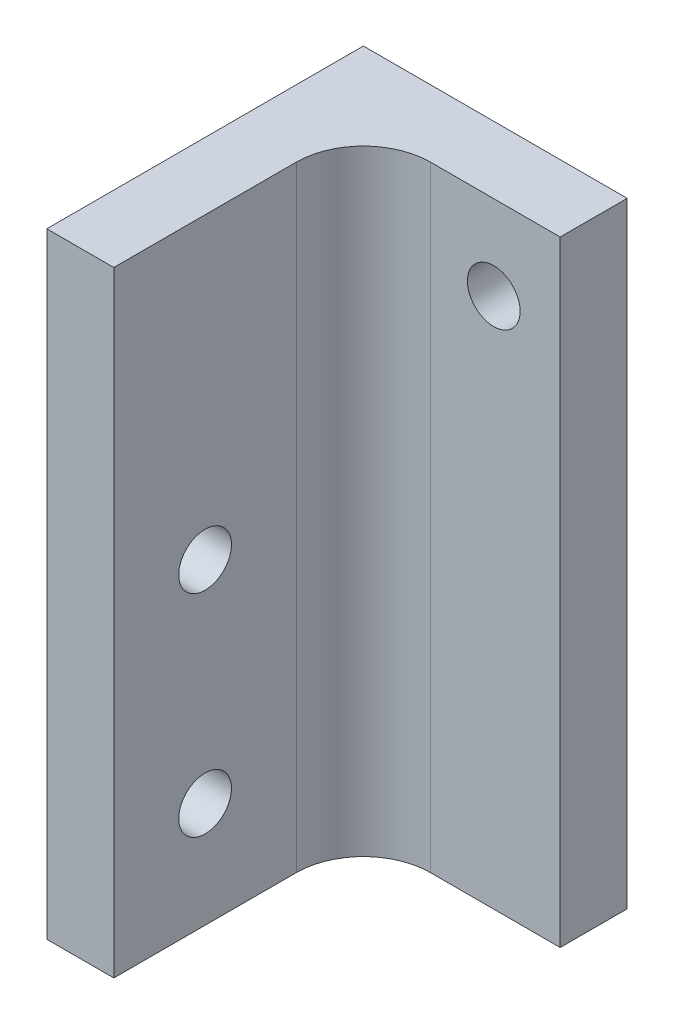
ISO-10303-21;
HEADER;
FILE_DESCRIPTION(('STEP AP214'),'2;1');
FILE_NAME('part.step','',(''),(''),'','','');
FILE_SCHEMA(('AUTOMOTIVE_DESIGN { 1 0 10303 214 1 1 1 1 }'));
ENDSEC;
DATA;
#1=APPLICATION_CONTEXT('core data for automotive mechanical design processes');
#2=APPLICATION_PROTOCOL_DEFINITION('international standard','automotive_design',2000,#1);
#3=PRODUCT_CONTEXT('',#1,'mechanical');
#4=PRODUCT('Part','Part','',(#3));
#5=PRODUCT_RELATED_PRODUCT_CATEGORY('part','',(#4));
#6=PRODUCT_DEFINITION_FORMATION('','',#4);
#7=PRODUCT_DEFINITION_CONTEXT('part definition',#1,'design');
#8=PRODUCT_DEFINITION('design','',#6,#7);
#9=PRODUCT_DEFINITION_SHAPE('','',#8);
#10=(LENGTH_UNIT() NAMED_UNIT(*) SI_UNIT(.MILLI.,.METRE.));
#11=(NAMED_UNIT(*) PLANE_ANGLE_UNIT() SI_UNIT($,.RADIAN.));
#12=(NAMED_UNIT(*) SI_UNIT($,.STERADIAN.) SOLID_ANGLE_UNIT());
#13=UNCERTAINTY_MEASURE_WITH_UNIT(LENGTH_MEASURE(1.E-05),#10,'distance_accuracy_value','');
#14=(GEOMETRIC_REPRESENTATION_CONTEXT(3) GLOBAL_UNCERTAINTY_ASSIGNED_CONTEXT((#13)) GLOBAL_UNIT_ASSIGNED_CONTEXT((#10,
#11,#12)) REPRESENTATION_CONTEXT('',''));
#15=CARTESIAN_POINT('',(0.,0.,0.));
#16=DIRECTION('',(0.,0.,1.));
#17=DIRECTION('',(1.,0.,0.));
#18=AXIS2_PLACEMENT_3D('',#15,#16,#17);
#19=CARTESIAN_POINT('',(0.,58.31,0.));
#20=DIRECTION('',(0.,0.,-1.));
#21=DIRECTION('',(-1.,0.,0.));
#22=AXIS2_PLACEMENT_3D('',#19,#20,#21);
#23=PLANE('',#22);
#24=DIRECTION('',(1.,0.,0.));
#25=VECTOR('',#24,1.);
#26=CARTESIAN_POINT('',(0.,0.,0.));
#27=LINE('',#26,#25);
#28=CARTESIAN_POINT('',(0.,0.,0.));
#29=VERTEX_POINT('',#28);
#30=CARTESIAN_POINT('',(6.35,0.,0.));
#31=VERTEX_POINT('',#30);
#32=EDGE_CURVE('E124',#29,#31,#27,.T.);
#33=ORIENTED_EDGE('',*,*,#32,.T.);
#34=DIRECTION('',(0.,-1.,0.));
#35=VECTOR('',#34,1.);
#36=CARTESIAN_POINT('',(6.35,58.31,0.));
#37=LINE('',#36,#35);
#38=CARTESIAN_POINT('',(6.35,58.31,0.));
#39=VERTEX_POINT('',#38);
#40=EDGE_CURVE('E11',#39,#31,#37,.T.);
#41=ORIENTED_EDGE('',*,*,#40,.F.);
#42=DIRECTION('',(1.,0.,0.));
#43=VECTOR('',#42,1.);
#44=CARTESIAN_POINT('',(0.,58.31,0.));
#45=LINE('',#44,#43);
#46=CARTESIAN_POINT('',(0.,58.31,0.));
#47=VERTEX_POINT('',#46);
#48=EDGE_CURVE('E137',#47,#39,#45,.T.);
#49=ORIENTED_EDGE('',*,*,#48,.F.);
#50=DIRECTION('',(0.,-1.,0.));
#51=VECTOR('',#50,1.);
#52=CARTESIAN_POINT('',(0.,58.31,0.));
#53=LINE('',#52,#51);
#54=EDGE_CURVE('E120',#47,#29,#53,.T.);
#55=ORIENTED_EDGE('',*,*,#54,.T.);
#56=EDGE_LOOP('',(#33,#41,#49,#55));
#57=FACE_BOUND('',#56,.T.);
#58=ADVANCED_FACE('F34',(#57),#23,.F.);
#59=CARTESIAN_POINT('',(6.35,58.31,0.));
#60=DIRECTION('',(-1.,0.,0.));
#61=DIRECTION('',(0.,0.,1.));
#62=AXIS2_PLACEMENT_3D('',#59,#60,#61);
#63=PLANE('',#62);
#64=CARTESIAN_POINT('',(6.35,10.,-8.65));
#65=DIRECTION('',(1.,0.,0.));
#66=DIRECTION('',(0.,0.,-1.));
#67=AXIS2_PLACEMENT_3D('',#64,#65,#66);
#68=CIRCLE('',#67,2.5);
#69=CARTESIAN_POINT('',(6.35,10.,-11.15));
#70=VERTEX_POINT('',#69);
#71=EDGE_CURVE('E167',#70,#70,#68,.T.);
#72=ORIENTED_EDGE('',*,*,#71,.F.);
#73=EDGE_LOOP('',(#72));
#74=FACE_BOUND('',#73,.T.);
#75=CARTESIAN_POINT('',(6.35,30.,-8.65));
#76=DIRECTION('',(1.,0.,0.));
#77=DIRECTION('',(0.,0.,-1.));
#78=AXIS2_PLACEMENT_3D('',#75,#76,#77);
#79=CIRCLE('',#78,2.5);
#80=CARTESIAN_POINT('',(6.35,30.,-11.15));
#81=VERTEX_POINT('',#80);
#82=EDGE_CURVE('E160',#81,#81,#79,.T.);
#83=ORIENTED_EDGE('',*,*,#82,.F.);
#84=EDGE_LOOP('',(#83));
#85=FACE_BOUND('',#84,.T.);
#86=DIRECTION('',(0.,0.,-1.));
#87=VECTOR('',#86,1.);
#88=CARTESIAN_POINT('',(6.35,0.,0.));
#89=LINE('',#88,#87);
#90=CARTESIAN_POINT('',(6.35,0.,-17.3));
#91=VERTEX_POINT('',#90);
#92=EDGE_CURVE('E127',#31,#91,#89,.T.);
#93=ORIENTED_EDGE('',*,*,#92,.T.);
#94=DIRECTION('',(0.,-1.,0.));
#95=VECTOR('',#94,1.);
#96=CARTESIAN_POINT('',(6.35,58.31,-17.3));
#97=LINE('',#96,#95);
#98=CARTESIAN_POINT('',(6.35,58.31,-17.3));
#99=VERTEX_POINT('',#98);
#100=EDGE_CURVE('E42',#99,#91,#97,.T.);
#101=ORIENTED_EDGE('',*,*,#100,.F.);
#102=DIRECTION('',(0.,0.,-1.));
#103=VECTOR('',#102,1.);
#104=CARTESIAN_POINT('',(6.35,58.31,0.));
#105=LINE('',#104,#103);
#106=EDGE_CURVE('E90',#39,#99,#105,.T.);
#107=ORIENTED_EDGE('',*,*,#106,.F.);
#108=ORIENTED_EDGE('',*,*,#40,.T.);
#109=EDGE_LOOP('',(#93,#101,#107,#108));
#110=FACE_BOUND('',#109,.T.);
#111=ADVANCED_FACE('F193',(#74,#85,#110),#63,.F.);
#112=CARTESIAN_POINT('',(12.7,58.31,-17.3));
#113=DIRECTION('',(0.,-1.,0.));
#114=DIRECTION('',(0.,0.,-1.));
#115=AXIS2_PLACEMENT_3D('',#112,#113,#114);
#116=CYLINDRICAL_SURFACE('',#115,6.35);
#117=CARTESIAN_POINT('',(12.7,0.,-17.3));
#118=DIRECTION('',(0.,-1.,0.));
#119=DIRECTION('',(0.,0.,-1.));
#120=AXIS2_PLACEMENT_3D('',#117,#118,#119);
#121=CIRCLE('',#120,6.35);
#122=CARTESIAN_POINT('',(12.7,0.,-23.65));
#123=VERTEX_POINT('',#122);
#124=EDGE_CURVE('E130',#91,#123,#121,.T.);
#125=ORIENTED_EDGE('',*,*,#124,.T.);
#126=DIRECTION('',(0.,-1.,0.));
#127=VECTOR('',#126,1.);
#128=CARTESIAN_POINT('',(12.7,58.31,-23.65));
#129=LINE('',#128,#127);
#130=CARTESIAN_POINT('',(12.7,58.31,-23.65));
#131=VERTEX_POINT('',#130);
#132=EDGE_CURVE('E141',#131,#123,#129,.T.);
#133=ORIENTED_EDGE('',*,*,#132,.F.);
#134=CARTESIAN_POINT('',(12.7,58.31,-17.3));
#135=DIRECTION('',(0.,-1.,0.));
#136=DIRECTION('',(0.,0.,-1.));
#137=AXIS2_PLACEMENT_3D('',#134,#135,#136);
#138=CIRCLE('',#137,6.35);
#139=EDGE_CURVE('E149',#99,#131,#138,.T.);
#140=ORIENTED_EDGE('',*,*,#139,.F.);
#141=ORIENTED_EDGE('',*,*,#100,.T.);
#142=EDGE_LOOP('',(#125,#133,#140,#141));
#143=FACE_BOUND('',#142,.T.);
#144=ADVANCED_FACE('F147',(#143),#116,.F.);
#145=CARTESIAN_POINT('',(12.7,58.31,-23.65));
#146=DIRECTION('',(0.,0.,-1.));
#147=DIRECTION('',(-1.,0.,0.));
#148=AXIS2_PLACEMENT_3D('',#145,#146,#147);
#149=PLANE('',#148);
#150=CARTESIAN_POINT('',(18.7067209617219,50.31,-23.65));
#151=DIRECTION('',(0.,0.,1.));
#152=DIRECTION('',(1.,0.,0.));
#153=AXIS2_PLACEMENT_3D('',#150,#151,#152);
#154=CIRCLE('',#153,2.5);
#155=CARTESIAN_POINT('',(21.2067209617219,50.31,-23.65));
#156=VERTEX_POINT('',#155);
#157=EDGE_CURVE('E172',#156,#156,#154,.T.);
#158=ORIENTED_EDGE('',*,*,#157,.F.);
#159=EDGE_LOOP('',(#158));
#160=FACE_BOUND('',#159,.T.);
#161=DIRECTION('',(1.,0.,0.));
#162=VECTOR('',#161,1.);
#163=CARTESIAN_POINT('',(12.7,0.,-23.65));
#164=LINE('',#163,#162);
#165=CARTESIAN_POINT('',(25.,0.,-23.65));
#166=VERTEX_POINT('',#165);
#167=EDGE_CURVE('E132',#123,#166,#164,.T.);
#168=ORIENTED_EDGE('',*,*,#167,.T.);
#169=DIRECTION('',(0.,-1.,0.));
#170=VECTOR('',#169,1.);
#171=CARTESIAN_POINT('',(25.,58.31,-23.65));
#172=LINE('',#171,#170);
#173=CARTESIAN_POINT('',(25.,58.31,-23.65));
#174=VERTEX_POINT('',#173);
#175=EDGE_CURVE('E115',#174,#166,#172,.T.);
#176=ORIENTED_EDGE('',*,*,#175,.F.);
#177=DIRECTION('',(1.,0.,0.));
#178=VECTOR('',#177,1.);
#179=CARTESIAN_POINT('',(12.7,58.31,-23.65));
#180=LINE('',#179,#178);
#181=EDGE_CURVE('E106',#131,#174,#180,.T.);
#182=ORIENTED_EDGE('',*,*,#181,.F.);
#183=ORIENTED_EDGE('',*,*,#132,.T.);
#184=EDGE_LOOP('',(#168,#176,#182,#183));
#185=FACE_BOUND('',#184,.T.);
#186=ADVANCED_FACE('F155',(#160,#185),#149,.F.);
#187=CARTESIAN_POINT('',(25.,58.31,-30.));
#188=DIRECTION('',(-1.,0.,0.));
#189=DIRECTION('',(0.,0.,1.));
#190=AXIS2_PLACEMENT_3D('',#187,#188,#189);
#191=PLANE('',#190);
#192=DIRECTION('',(0.,0.,-1.));
#193=VECTOR('',#192,1.);
#194=CARTESIAN_POINT('',(25.,0.,-30.));
#195=LINE('',#194,#193);
#196=CARTESIAN_POINT('',(25.,0.,-30.));
#197=VERTEX_POINT('',#196);
#198=EDGE_CURVE('E114',#166,#197,#195,.T.);
#199=ORIENTED_EDGE('',*,*,#198,.T.);
#200=DIRECTION('',(0.,-1.,0.));
#201=VECTOR('',#200,1.);
#202=CARTESIAN_POINT('',(25.,58.31,-30.));
#203=LINE('',#202,#201);
#204=CARTESIAN_POINT('',(25.,58.31,-30.));
#205=VERTEX_POINT('',#204);
#206=EDGE_CURVE('E111',#205,#197,#203,.T.);
#207=ORIENTED_EDGE('',*,*,#206,.F.);
#208=DIRECTION('',(0.,0.,-1.));
#209=VECTOR('',#208,1.);
#210=CARTESIAN_POINT('',(25.,58.31,-30.));
#211=LINE('',#210,#209);
#212=EDGE_CURVE('E100',#174,#205,#211,.T.);
#213=ORIENTED_EDGE('',*,*,#212,.F.);
#214=ORIENTED_EDGE('',*,*,#175,.T.);
#215=EDGE_LOOP('',(#199,#207,#213,#214));
#216=FACE_BOUND('',#215,.T.);
#217=ADVANCED_FACE('F112',(#216),#191,.F.);
#218=CARTESIAN_POINT('',(0.,58.31,-30.));
#219=DIRECTION('',(0.,0.,1.));
#220=DIRECTION('',(1.,0.,0.));
#221=AXIS2_PLACEMENT_3D('',#218,#219,#220);
#222=PLANE('',#221);
#223=CARTESIAN_POINT('',(18.7067209617219,50.31,-30.));
#224=DIRECTION('',(0.,0.,1.));
#225=DIRECTION('',(1.,0.,0.));
#226=AXIS2_PLACEMENT_3D('',#223,#224,#225);
#227=CIRCLE('',#226,2.5);
#228=CARTESIAN_POINT('',(21.2067209617219,50.31,-30.));
#229=VERTEX_POINT('',#228);
#230=EDGE_CURVE('E164',#229,#229,#227,.T.);
#231=ORIENTED_EDGE('',*,*,#230,.T.);
#232=EDGE_LOOP('',(#231));
#233=FACE_BOUND('',#232,.T.);
#234=DIRECTION('',(-1.,0.,0.));
#235=VECTOR('',#234,1.);
#236=CARTESIAN_POINT('',(0.,0.,-30.));
#237=LINE('',#236,#235);
#238=CARTESIAN_POINT('',(0.,0.,-30.));
#239=VERTEX_POINT('',#238);
#240=EDGE_CURVE('E76',#197,#239,#237,.T.);
#241=ORIENTED_EDGE('',*,*,#240,.T.);
#242=DIRECTION('',(0.,-1.,0.));
#243=VECTOR('',#242,1.);
#244=CARTESIAN_POINT('',(0.,58.31,-30.));
#245=LINE('',#244,#243);
#246=CARTESIAN_POINT('',(0.,58.31,-30.));
#247=VERTEX_POINT('',#246);
#248=EDGE_CURVE('E116',#247,#239,#245,.T.);
#249=ORIENTED_EDGE('',*,*,#248,.F.);
#250=DIRECTION('',(-1.,0.,0.));
#251=VECTOR('',#250,1.);
#252=CARTESIAN_POINT('',(0.,58.31,-30.));
#253=LINE('',#252,#251);
#254=EDGE_CURVE('E104',#205,#247,#253,.T.);
#255=ORIENTED_EDGE('',*,*,#254,.F.);
#256=ORIENTED_EDGE('',*,*,#206,.T.);
#257=EDGE_LOOP('',(#241,#249,#255,#256));
#258=FACE_BOUND('',#257,.T.);
#259=ADVANCED_FACE('F118',(#233,#258),#222,.F.);
#260=CARTESIAN_POINT('',(0.,58.31,0.));
#261=DIRECTION('',(1.,0.,0.));
#262=DIRECTION('',(0.,0.,-1.));
#263=AXIS2_PLACEMENT_3D('',#260,#261,#262);
#264=PLANE('',#263);
#265=CARTESIAN_POINT('',(0.,10.,-8.65));
#266=DIRECTION('',(1.,0.,0.));
#267=DIRECTION('',(0.,0.,-1.));
#268=AXIS2_PLACEMENT_3D('',#265,#266,#267);
#269=CIRCLE('',#268,2.5);
#270=CARTESIAN_POINT('',(0.,10.,-11.15));
#271=VERTEX_POINT('',#270);
#272=EDGE_CURVE('E128',#271,#271,#269,.T.);
#273=ORIENTED_EDGE('',*,*,#272,.T.);
#274=EDGE_LOOP('',(#273));
#275=FACE_BOUND('',#274,.T.);
#276=CARTESIAN_POINT('',(0.,30.,-8.65));
#277=DIRECTION('',(1.,0.,0.));
#278=DIRECTION('',(0.,0.,-1.));
#279=AXIS2_PLACEMENT_3D('',#276,#277,#278);
#280=CIRCLE('',#279,2.5);
#281=CARTESIAN_POINT('',(0.,30.,-11.15));
#282=VERTEX_POINT('',#281);
#283=EDGE_CURVE('E163',#282,#282,#280,.T.);
#284=ORIENTED_EDGE('',*,*,#283,.T.);
#285=EDGE_LOOP('',(#284));
#286=FACE_BOUND('',#285,.T.);
#287=DIRECTION('',(0.,0.,1.));
#288=VECTOR('',#287,1.);
#289=CARTESIAN_POINT('',(0.,0.,0.));
#290=LINE('',#289,#288);
#291=EDGE_CURVE('E82',#239,#29,#290,.T.);
#292=ORIENTED_EDGE('',*,*,#291,.T.);
#293=ORIENTED_EDGE('',*,*,#54,.F.);
#294=DIRECTION('',(0.,0.,1.));
#295=VECTOR('',#294,1.);
#296=CARTESIAN_POINT('',(0.,58.31,0.));
#297=LINE('',#296,#295);
#298=EDGE_CURVE('E50',#247,#47,#297,.T.);
#299=ORIENTED_EDGE('',*,*,#298,.F.);
#300=ORIENTED_EDGE('',*,*,#248,.T.);
#301=EDGE_LOOP('',(#292,#293,#299,#300));
#302=FACE_BOUND('',#301,.T.);
#303=ADVANCED_FACE('F203',(#275,#286,#302),#264,.F.);
#304=CARTESIAN_POINT('',(12.7,58.31,-17.3));
#305=DIRECTION('',(0.,-1.,0.));
#306=DIRECTION('',(0.,0.,-1.));
#307=AXIS2_PLACEMENT_3D('',#304,#305,#306);
#308=PLANE('',#307);
#309=ORIENTED_EDGE('',*,*,#48,.T.);
#310=ORIENTED_EDGE('',*,*,#106,.T.);
#311=ORIENTED_EDGE('',*,*,#139,.T.);
#312=ORIENTED_EDGE('',*,*,#181,.T.);
#313=ORIENTED_EDGE('',*,*,#212,.T.);
#314=ORIENTED_EDGE('',*,*,#254,.T.);
#315=ORIENTED_EDGE('',*,*,#298,.T.);
#316=EDGE_LOOP('',(#309,#310,#311,#312,#313,#314,#315));
#317=FACE_BOUND('',#316,.T.);
#318=ADVANCED_FACE('F102',(#317),#308,.F.);
#319=CARTESIAN_POINT('',(12.7,0.,-17.3));
#320=DIRECTION('',(0.,-1.,0.));
#321=DIRECTION('',(0.,0.,-1.));
#322=AXIS2_PLACEMENT_3D('',#319,#320,#321);
#323=PLANE('',#322);
#324=ORIENTED_EDGE('',*,*,#32,.F.);
#325=ORIENTED_EDGE('',*,*,#291,.F.);
#326=ORIENTED_EDGE('',*,*,#240,.F.);
#327=ORIENTED_EDGE('',*,*,#198,.F.);
#328=ORIENTED_EDGE('',*,*,#167,.F.);
#329=ORIENTED_EDGE('',*,*,#124,.F.);
#330=ORIENTED_EDGE('',*,*,#92,.F.);
#331=EDGE_LOOP('',(#324,#325,#326,#327,#328,#329,#330));
#332=FACE_BOUND('',#331,.T.);
#333=ADVANCED_FACE('F153',(#332),#323,.T.);
#334=CARTESIAN_POINT('',(0.,30.,-8.65));
#335=DIRECTION('',(1.,0.,0.));
#336=DIRECTION('',(0.,0.,-1.));
#337=AXIS2_PLACEMENT_3D('',#334,#335,#336);
#338=CYLINDRICAL_SURFACE('',#337,2.5);
#339=ORIENTED_EDGE('',*,*,#283,.F.);
#340=EDGE_LOOP('',(#339));
#341=FACE_BOUND('',#340,.T.);
#342=ORIENTED_EDGE('',*,*,#82,.T.);
#343=EDGE_LOOP('',(#342));
#344=FACE_BOUND('',#343,.T.);
#345=ADVANCED_FACE('F216',(#341,#344),#338,.F.);
#346=CARTESIAN_POINT('',(0.,10.,-8.65));
#347=DIRECTION('',(1.,0.,0.));
#348=DIRECTION('',(0.,0.,-1.));
#349=AXIS2_PLACEMENT_3D('',#346,#347,#348);
#350=CYLINDRICAL_SURFACE('',#349,2.5);
#351=ORIENTED_EDGE('',*,*,#272,.F.);
#352=EDGE_LOOP('',(#351));
#353=FACE_BOUND('',#352,.T.);
#354=ORIENTED_EDGE('',*,*,#71,.T.);
#355=EDGE_LOOP('',(#354));
#356=FACE_BOUND('',#355,.T.);
#357=ADVANCED_FACE('F182',(#353,#356),#350,.F.);
#358=CARTESIAN_POINT('',(18.7067209617219,50.31,-30.));
#359=DIRECTION('',(0.,0.,1.));
#360=DIRECTION('',(1.,0.,0.));
#361=AXIS2_PLACEMENT_3D('',#358,#359,#360);
#362=CYLINDRICAL_SURFACE('',#361,2.5);
#363=ORIENTED_EDGE('',*,*,#230,.F.);
#364=EDGE_LOOP('',(#363));
#365=FACE_BOUND('',#364,.T.);
#366=ORIENTED_EDGE('',*,*,#157,.T.);
#367=EDGE_LOOP('',(#366));
#368=FACE_BOUND('',#367,.T.);
#369=ADVANCED_FACE('F179',(#365,#368),#362,.F.);
#370=CLOSED_SHELL('',(#58,#111,#144,#186,#217,#259,#303,#318,#333,#345,#357,#369));
#371=MANIFOLD_SOLID_BREP('B2',#370);
#372=ADVANCED_BREP_SHAPE_REPRESENTATION('',(#18,#371),#14);
#373=SHAPE_DEFINITION_REPRESENTATION(#9,#372);
ENDSEC;
END-ISO-10303-21;
